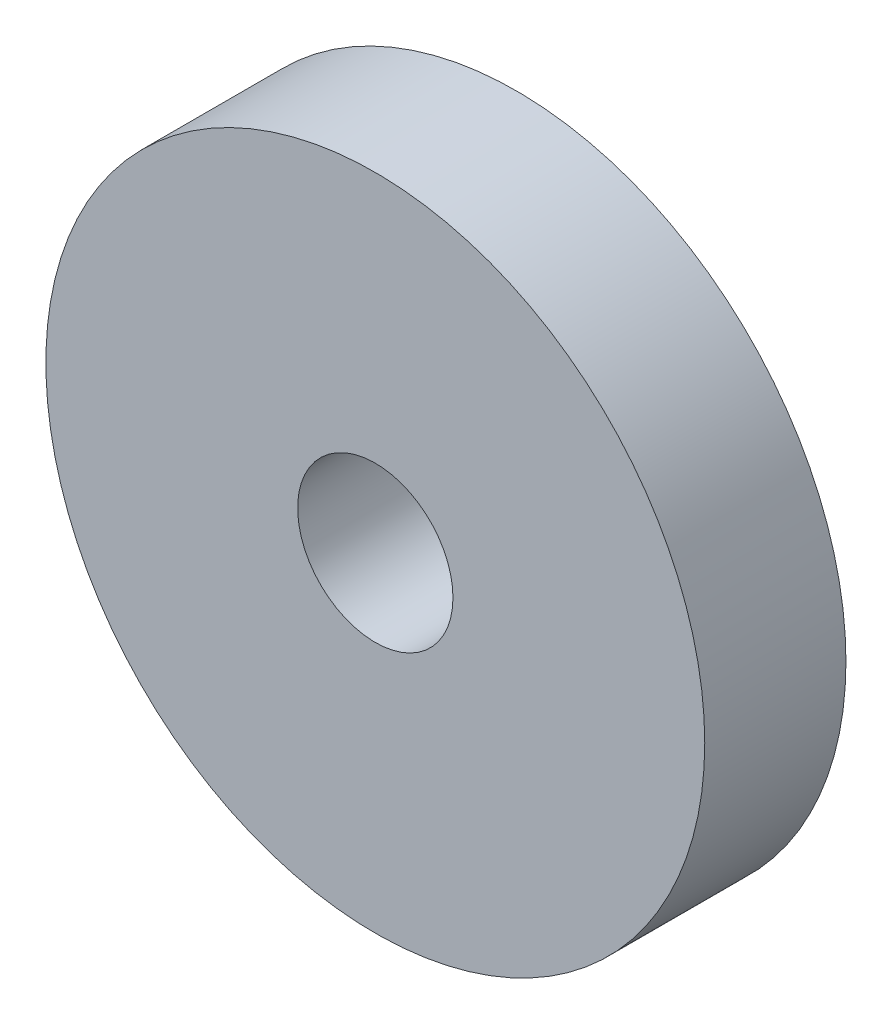
ISO-10303-21;
HEADER;
FILE_DESCRIPTION(('STEP AP214'),'2;1');
FILE_NAME('part.step','',(''),(''),'','','');
FILE_SCHEMA(('AUTOMOTIVE_DESIGN { 1 0 10303 214 1 1 1 1 }'));
ENDSEC;
DATA;
#1=APPLICATION_CONTEXT('core data for automotive mechanical design processes');
#2=APPLICATION_PROTOCOL_DEFINITION('international standard','automotive_design',2000,#1);
#3=PRODUCT_CONTEXT('',#1,'mechanical');
#4=PRODUCT('Part','Part','',(#3));
#5=PRODUCT_RELATED_PRODUCT_CATEGORY('part','',(#4));
#6=PRODUCT_DEFINITION_FORMATION('','',#4);
#7=PRODUCT_DEFINITION_CONTEXT('part definition',#1,'design');
#8=PRODUCT_DEFINITION('design','',#6,#7);
#9=PRODUCT_DEFINITION_SHAPE('','',#8);
#10=(LENGTH_UNIT() NAMED_UNIT(*) SI_UNIT(.MILLI.,.METRE.));
#11=(NAMED_UNIT(*) PLANE_ANGLE_UNIT() SI_UNIT($,.RADIAN.));
#12=(NAMED_UNIT(*) SI_UNIT($,.STERADIAN.) SOLID_ANGLE_UNIT());
#13=UNCERTAINTY_MEASURE_WITH_UNIT(LENGTH_MEASURE(1.E-05),#10,'distance_accuracy_value','');
#14=(GEOMETRIC_REPRESENTATION_CONTEXT(3) GLOBAL_UNCERTAINTY_ASSIGNED_CONTEXT((#13)) GLOBAL_UNIT_ASSIGNED_CONTEXT((#10,
#11,#12)) REPRESENTATION_CONTEXT('',''));
#15=CARTESIAN_POINT('',(0.,0.,0.));
#16=DIRECTION('',(0.,0.,1.));
#17=DIRECTION('',(1.,0.,0.));
#18=AXIS2_PLACEMENT_3D('',#15,#16,#17);
#19=CARTESIAN_POINT('',(0.,0.,3.));
#20=DIRECTION('',(0.,0.,-1.));
#21=DIRECTION('',(-1.,0.,0.));
#22=AXIS2_PLACEMENT_3D('',#19,#20,#21);
#23=CYLINDRICAL_SURFACE('',#22,7.);
#24=CARTESIAN_POINT('',(0.,0.,3.));
#25=DIRECTION('',(0.,0.,1.));
#26=DIRECTION('',(1.,0.,0.));
#27=AXIS2_PLACEMENT_3D('',#24,#25,#26);
#28=CIRCLE('',#27,7.);
#29=CARTESIAN_POINT('',(7.,0.,3.));
#30=VERTEX_POINT('',#29);
#31=EDGE_CURVE('E10',#30,#30,#28,.T.);
#32=ORIENTED_EDGE('',*,*,#31,.F.);
#33=EDGE_LOOP('',(#32));
#34=FACE_BOUND('',#33,.T.);
#35=CARTESIAN_POINT('',(0.,0.,0.));
#36=DIRECTION('',(0.,0.,1.));
#37=DIRECTION('',(1.,0.,0.));
#38=AXIS2_PLACEMENT_3D('',#35,#36,#37);
#39=CIRCLE('',#38,7.);
#40=CARTESIAN_POINT('',(7.,0.,0.));
#41=VERTEX_POINT('',#40);
#42=EDGE_CURVE('E43',#41,#41,#39,.T.);
#43=ORIENTED_EDGE('',*,*,#42,.T.);
#44=EDGE_LOOP('',(#43));
#45=FACE_BOUND('',#44,.T.);
#46=ADVANCED_FACE('F40',(#34,#45),#23,.T.);
#47=CARTESIAN_POINT('',(0.,0.,3.));
#48=DIRECTION('',(0.,0.,1.));
#49=DIRECTION('',(1.,0.,0.));
#50=AXIS2_PLACEMENT_3D('',#47,#48,#49);
#51=PLANE('',#50);
#52=CARTESIAN_POINT('',(0.,0.,3.));
#53=DIRECTION('',(0.,0.,1.));
#54=DIRECTION('',(1.,0.,0.));
#55=AXIS2_PLACEMENT_3D('',#52,#53,#54);
#56=CIRCLE('',#55,1.65);
#57=CARTESIAN_POINT('',(1.65,0.,3.));
#58=VERTEX_POINT('',#57);
#59=EDGE_CURVE('E57',#58,#58,#56,.T.);
#60=ORIENTED_EDGE('',*,*,#59,.F.);
#61=EDGE_LOOP('',(#60));
#62=FACE_BOUND('',#61,.T.);
#63=ORIENTED_EDGE('',*,*,#31,.T.);
#64=EDGE_LOOP('',(#63));
#65=FACE_BOUND('',#64,.T.);
#66=ADVANCED_FACE('F64',(#62,#65),#51,.T.);
#67=CARTESIAN_POINT('',(0.,0.,0.));
#68=DIRECTION('',(0.,0.,1.));
#69=DIRECTION('',(1.,0.,0.));
#70=AXIS2_PLACEMENT_3D('',#67,#68,#69);
#71=PLANE('',#70);
#72=CARTESIAN_POINT('',(0.,0.,0.));
#73=DIRECTION('',(0.,0.,1.));
#74=DIRECTION('',(1.,0.,0.));
#75=AXIS2_PLACEMENT_3D('',#72,#73,#74);
#76=CIRCLE('',#75,1.65);
#77=CARTESIAN_POINT('',(1.65,0.,0.));
#78=VERTEX_POINT('',#77);
#79=EDGE_CURVE('E52',#78,#78,#76,.F.);
#80=ORIENTED_EDGE('',*,*,#79,.F.);
#81=EDGE_LOOP('',(#80));
#82=FACE_BOUND('',#81,.T.);
#83=ORIENTED_EDGE('',*,*,#42,.F.);
#84=EDGE_LOOP('',(#83));
#85=FACE_BOUND('',#84,.T.);
#86=ADVANCED_FACE('F66',(#82,#85),#71,.F.);
#87=CARTESIAN_POINT('',(0.,0.,-4.66690475583121));
#88=DIRECTION('',(0.,0.,1.));
#89=DIRECTION('',(1.,0.,0.));
#90=AXIS2_PLACEMENT_3D('',#87,#88,#89);
#91=CYLINDRICAL_SURFACE('',#90,1.65);
#92=ORIENTED_EDGE('',*,*,#79,.T.);
#93=EDGE_LOOP('',(#92));
#94=FACE_BOUND('',#93,.T.);
#95=ORIENTED_EDGE('',*,*,#59,.T.);
#96=EDGE_LOOP('',(#95));
#97=FACE_BOUND('',#96,.T.);
#98=ADVANCED_FACE('F62',(#94,#97),#91,.F.);
#99=CLOSED_SHELL('',(#46,#66,#86,#98));
#100=MANIFOLD_SOLID_BREP('B2',#99);
#101=ADVANCED_BREP_SHAPE_REPRESENTATION('',(#18,#100),#14);
#102=SHAPE_DEFINITION_REPRESENTATION(#9,#101);
ENDSEC;
END-ISO-10303-21;
